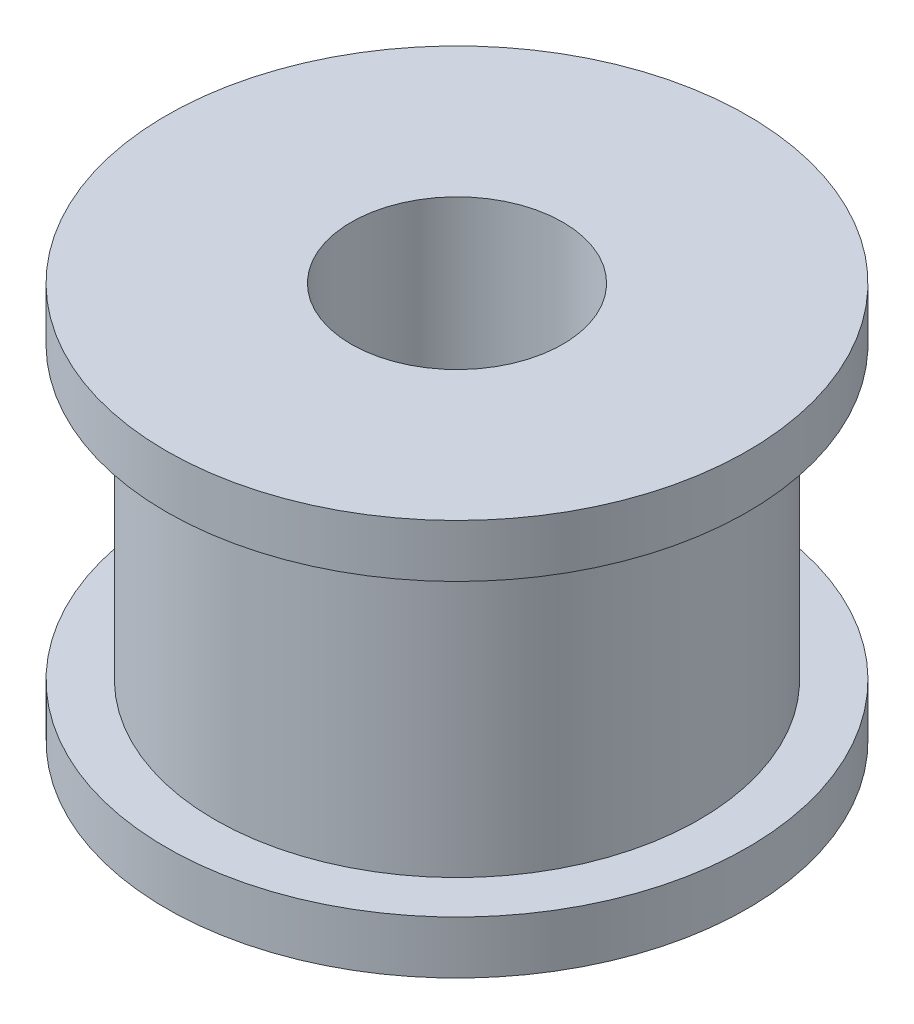
ISO-10303-21;
HEADER;
FILE_DESCRIPTION(('STEP AP214'),'2;1');
FILE_NAME('part.step','',(''),(''),'','','');
FILE_SCHEMA(('AUTOMOTIVE_DESIGN { 1 0 10303 214 1 1 1 1 }'));
ENDSEC;
DATA;
#1=APPLICATION_CONTEXT('core data for automotive mechanical design processes');
#2=APPLICATION_PROTOCOL_DEFINITION('international standard','automotive_design',2000,#1);
#3=PRODUCT_CONTEXT('',#1,'mechanical');
#4=PRODUCT('Part','Part','',(#3));
#5=PRODUCT_RELATED_PRODUCT_CATEGORY('part','',(#4));
#6=PRODUCT_DEFINITION_FORMATION('','',#4);
#7=PRODUCT_DEFINITION_CONTEXT('part definition',#1,'design');
#8=PRODUCT_DEFINITION('design','',#6,#7);
#9=PRODUCT_DEFINITION_SHAPE('','',#8);
#10=(LENGTH_UNIT() NAMED_UNIT(*) SI_UNIT(.MILLI.,.METRE.));
#11=(NAMED_UNIT(*) PLANE_ANGLE_UNIT() SI_UNIT($,.RADIAN.));
#12=(NAMED_UNIT(*) SI_UNIT($,.STERADIAN.) SOLID_ANGLE_UNIT());
#13=UNCERTAINTY_MEASURE_WITH_UNIT(LENGTH_MEASURE(1.E-05),#10,'distance_accuracy_value','');
#14=(GEOMETRIC_REPRESENTATION_CONTEXT(3) GLOBAL_UNCERTAINTY_ASSIGNED_CONTEXT((#13)) GLOBAL_UNIT_ASSIGNED_CONTEXT((#10,
#11,#12)) REPRESENTATION_CONTEXT('',''));
#15=CARTESIAN_POINT('',(0.,0.,0.));
#16=DIRECTION('',(0.,0.,1.));
#17=DIRECTION('',(1.,0.,0.));
#18=AXIS2_PLACEMENT_3D('',#15,#16,#17);
#19=CARTESIAN_POINT('',(0.,11.,0.));
#20=DIRECTION('',(0.,-1.,0.));
#21=DIRECTION('',(0.,0.,-1.));
#22=AXIS2_PLACEMENT_3D('',#19,#20,#21);
#23=CYLINDRICAL_SURFACE('',#22,9.17);
#24=CARTESIAN_POINT('',(0.,11.,0.));
#25=DIRECTION('',(0.,1.,0.));
#26=DIRECTION('',(0.,0.,1.));
#27=AXIS2_PLACEMENT_3D('',#24,#25,#26);
#28=CIRCLE('',#27,9.17);
#29=CARTESIAN_POINT('',(0.,11.,9.17));
#30=VERTEX_POINT('',#29);
#31=EDGE_CURVE('E10',#30,#30,#28,.T.);
#32=ORIENTED_EDGE('',*,*,#31,.F.);
#33=EDGE_LOOP('',(#32));
#34=FACE_BOUND('',#33,.T.);
#35=CARTESIAN_POINT('',(0.,0.,0.));
#36=DIRECTION('',(0.,1.,0.));
#37=DIRECTION('',(0.,0.,1.));
#38=AXIS2_PLACEMENT_3D('',#35,#36,#37);
#39=CIRCLE('',#38,9.17);
#40=CARTESIAN_POINT('',(0.,0.,9.17));
#41=VERTEX_POINT('',#40);
#42=EDGE_CURVE('E40',#41,#41,#39,.T.);
#43=ORIENTED_EDGE('',*,*,#42,.T.);
#44=EDGE_LOOP('',(#43));
#45=FACE_BOUND('',#44,.T.);
#46=ADVANCED_FACE('F37',(#34,#45),#23,.T.);
#47=CARTESIAN_POINT('',(0.,13.,0.));
#48=DIRECTION('',(0.,-1.,0.));
#49=DIRECTION('',(0.,0.,-1.));
#50=AXIS2_PLACEMENT_3D('',#47,#48,#49);
#51=CYLINDRICAL_SURFACE('',#50,11.);
#52=CARTESIAN_POINT('',(0.,13.,0.));
#53=DIRECTION('',(0.,1.,0.));
#54=DIRECTION('',(0.,0.,1.));
#55=AXIS2_PLACEMENT_3D('',#52,#53,#54);
#56=CIRCLE('',#55,11.);
#57=CARTESIAN_POINT('',(0.,13.,11.));
#58=VERTEX_POINT('',#57);
#59=EDGE_CURVE('E45',#58,#58,#56,.T.);
#60=ORIENTED_EDGE('',*,*,#59,.F.);
#61=EDGE_LOOP('',(#60));
#62=FACE_BOUND('',#61,.T.);
#63=CARTESIAN_POINT('',(0.,11.,0.));
#64=DIRECTION('',(0.,1.,0.));
#65=DIRECTION('',(0.,0.,1.));
#66=AXIS2_PLACEMENT_3D('',#63,#64,#65);
#67=CIRCLE('',#66,11.);
#68=CARTESIAN_POINT('',(0.,11.,11.));
#69=VERTEX_POINT('',#68);
#70=EDGE_CURVE('E50',#69,#69,#67,.T.);
#71=ORIENTED_EDGE('',*,*,#70,.T.);
#72=EDGE_LOOP('',(#71));
#73=FACE_BOUND('',#72,.T.);
#74=ADVANCED_FACE('F103',(#62,#73),#51,.T.);
#75=CARTESIAN_POINT('',(0.,13.,0.));
#76=DIRECTION('',(0.,1.,0.));
#77=DIRECTION('',(0.,0.,1.));
#78=AXIS2_PLACEMENT_3D('',#75,#76,#77);
#79=PLANE('',#78);
#80=CARTESIAN_POINT('',(0.,13.,0.));
#81=DIRECTION('',(0.,-1.,0.));
#82=DIRECTION('',(0.,0.,-1.));
#83=AXIS2_PLACEMENT_3D('',#80,#81,#82);
#84=CIRCLE('',#83,4.005);
#85=CARTESIAN_POINT('',(0.,13.,-4.005));
#86=VERTEX_POINT('',#85);
#87=EDGE_CURVE('E61',#86,#86,#84,.T.);
#88=ORIENTED_EDGE('',*,*,#87,.T.);
#89=EDGE_LOOP('',(#88));
#90=FACE_BOUND('',#89,.T.);
#91=ORIENTED_EDGE('',*,*,#59,.T.);
#92=EDGE_LOOP('',(#91));
#93=FACE_BOUND('',#92,.T.);
#94=ADVANCED_FACE('F73',(#90,#93),#79,.T.);
#95=CARTESIAN_POINT('',(0.,11.,0.));
#96=DIRECTION('',(0.,1.,0.));
#97=DIRECTION('',(0.,0.,1.));
#98=AXIS2_PLACEMENT_3D('',#95,#96,#97);
#99=PLANE('',#98);
#100=ORIENTED_EDGE('',*,*,#31,.T.);
#101=EDGE_LOOP('',(#100));
#102=FACE_BOUND('',#101,.T.);
#103=ORIENTED_EDGE('',*,*,#70,.F.);
#104=EDGE_LOOP('',(#103));
#105=FACE_BOUND('',#104,.T.);
#106=ADVANCED_FACE('F92',(#102,#105),#99,.F.);
#107=CARTESIAN_POINT('',(0.,-2.,0.));
#108=DIRECTION('',(0.,1.,0.));
#109=DIRECTION('',(0.,0.,1.));
#110=AXIS2_PLACEMENT_3D('',#107,#108,#109);
#111=CYLINDRICAL_SURFACE('',#110,11.);
#112=CARTESIAN_POINT('',(0.,-2.,0.));
#113=DIRECTION('',(0.,-1.,0.));
#114=DIRECTION('',(0.,0.,-1.));
#115=AXIS2_PLACEMENT_3D('',#112,#113,#114);
#116=CIRCLE('',#115,11.);
#117=CARTESIAN_POINT('',(0.,-2.,-11.));
#118=VERTEX_POINT('',#117);
#119=EDGE_CURVE('E60',#118,#118,#116,.T.);
#120=ORIENTED_EDGE('',*,*,#119,.F.);
#121=EDGE_LOOP('',(#120));
#122=FACE_BOUND('',#121,.T.);
#123=CARTESIAN_POINT('',(0.,0.,0.));
#124=DIRECTION('',(0.,-1.,0.));
#125=DIRECTION('',(0.,0.,-1.));
#126=AXIS2_PLACEMENT_3D('',#123,#124,#125);
#127=CIRCLE('',#126,11.);
#128=CARTESIAN_POINT('',(0.,0.,-11.));
#129=VERTEX_POINT('',#128);
#130=EDGE_CURVE('E56',#129,#129,#127,.T.);
#131=ORIENTED_EDGE('',*,*,#130,.T.);
#132=EDGE_LOOP('',(#131));
#133=FACE_BOUND('',#132,.T.);
#134=ADVANCED_FACE('F86',(#122,#133),#111,.T.);
#135=CARTESIAN_POINT('',(0.,-2.,0.));
#136=DIRECTION('',(0.,-1.,0.));
#137=DIRECTION('',(0.,0.,-1.));
#138=AXIS2_PLACEMENT_3D('',#135,#136,#137);
#139=PLANE('',#138);
#140=CARTESIAN_POINT('',(0.,-2.,0.));
#141=DIRECTION('',(0.,-1.,0.));
#142=DIRECTION('',(0.,0.,-1.));
#143=AXIS2_PLACEMENT_3D('',#140,#141,#142);
#144=CIRCLE('',#143,4.005);
#145=CARTESIAN_POINT('',(0.,-2.,-4.005));
#146=VERTEX_POINT('',#145);
#147=EDGE_CURVE('E65',#146,#146,#144,.T.);
#148=ORIENTED_EDGE('',*,*,#147,.F.);
#149=EDGE_LOOP('',(#148));
#150=FACE_BOUND('',#149,.T.);
#151=ORIENTED_EDGE('',*,*,#119,.T.);
#152=EDGE_LOOP('',(#151));
#153=FACE_BOUND('',#152,.T.);
#154=ADVANCED_FACE('F83',(#150,#153),#139,.T.);
#155=CARTESIAN_POINT('',(0.,0.,0.));
#156=DIRECTION('',(0.,-1.,0.));
#157=DIRECTION('',(0.,0.,-1.));
#158=AXIS2_PLACEMENT_3D('',#155,#156,#157);
#159=PLANE('',#158);
#160=ORIENTED_EDGE('',*,*,#42,.F.);
#161=EDGE_LOOP('',(#160));
#162=FACE_BOUND('',#161,.T.);
#163=ORIENTED_EDGE('',*,*,#130,.F.);
#164=EDGE_LOOP('',(#163));
#165=FACE_BOUND('',#164,.T.);
#166=ADVANCED_FACE('F79',(#162,#165),#159,.F.);
#167=CARTESIAN_POINT('',(0.,13.,0.));
#168=DIRECTION('',(0.,-1.,0.));
#169=DIRECTION('',(0.,0.,-1.));
#170=AXIS2_PLACEMENT_3D('',#167,#168,#169);
#171=CYLINDRICAL_SURFACE('',#170,4.005);
#172=ORIENTED_EDGE('',*,*,#87,.F.);
#173=EDGE_LOOP('',(#172));
#174=FACE_BOUND('',#173,.T.);
#175=ORIENTED_EDGE('',*,*,#147,.T.);
#176=EDGE_LOOP('',(#175));
#177=FACE_BOUND('',#176,.T.);
#178=ADVANCED_FACE('F76',(#174,#177),#171,.F.);
#179=CLOSED_SHELL('',(#46,#74,#94,#106,#134,#154,#166,#178));
#180=MANIFOLD_SOLID_BREP('B2',#179);
#181=ADVANCED_BREP_SHAPE_REPRESENTATION('',(#18,#180),#14);
#182=SHAPE_DEFINITION_REPRESENTATION(#9,#181);
ENDSEC;
END-ISO-10303-21;
